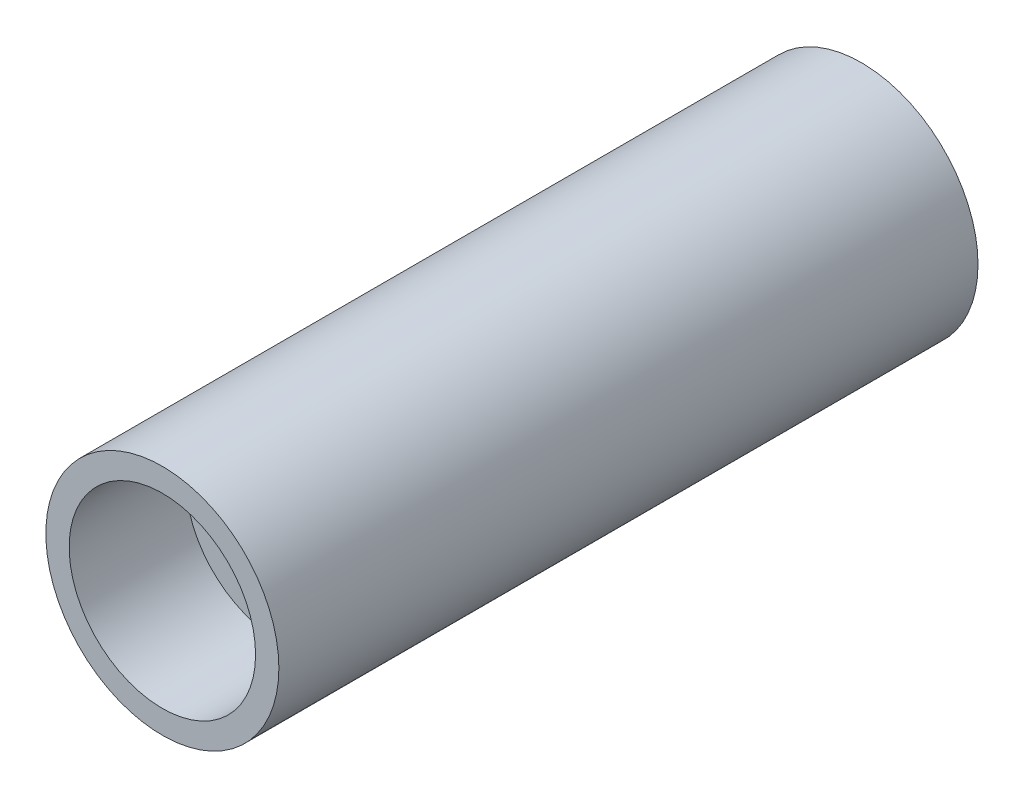
ISO-10303-21;
HEADER;
FILE_DESCRIPTION(('STEP AP214'),'2;1');
FILE_NAME('part.step','',(''),(''),'','','');
FILE_SCHEMA(('AUTOMOTIVE_DESIGN { 1 0 10303 214 1 1 1 1 }'));
ENDSEC;
DATA;
#1=APPLICATION_CONTEXT('core data for automotive mechanical design processes');
#2=APPLICATION_PROTOCOL_DEFINITION('international standard','automotive_design',2000,#1);
#3=PRODUCT_CONTEXT('',#1,'mechanical');
#4=PRODUCT('Part','Part','',(#3));
#5=PRODUCT_RELATED_PRODUCT_CATEGORY('part','',(#4));
#6=PRODUCT_DEFINITION_FORMATION('','',#4);
#7=PRODUCT_DEFINITION_CONTEXT('part definition',#1,'design');
#8=PRODUCT_DEFINITION('design','',#6,#7);
#9=PRODUCT_DEFINITION_SHAPE('','',#8);
#10=(LENGTH_UNIT() NAMED_UNIT(*) SI_UNIT(.MILLI.,.METRE.));
#11=(NAMED_UNIT(*) PLANE_ANGLE_UNIT() SI_UNIT($,.RADIAN.));
#12=(NAMED_UNIT(*) SI_UNIT($,.STERADIAN.) SOLID_ANGLE_UNIT());
#13=UNCERTAINTY_MEASURE_WITH_UNIT(LENGTH_MEASURE(1.E-05),#10,'distance_accuracy_value','');
#14=(GEOMETRIC_REPRESENTATION_CONTEXT(3) GLOBAL_UNCERTAINTY_ASSIGNED_CONTEXT((#13)) GLOBAL_UNIT_ASSIGNED_CONTEXT((#10,
#11,#12)) REPRESENTATION_CONTEXT('',''));
#15=CARTESIAN_POINT('',(0.,0.,0.));
#16=DIRECTION('',(0.,0.,1.));
#17=DIRECTION('',(1.,0.,0.));
#18=AXIS2_PLACEMENT_3D('',#15,#16,#17);
#19=CARTESIAN_POINT('',(0.,0.,30.));
#20=DIRECTION('',(0.,0.,-1.));
#21=DIRECTION('',(-1.,0.,0.));
#22=AXIS2_PLACEMENT_3D('',#19,#20,#21);
#23=CYLINDRICAL_SURFACE('',#22,5.);
#24=CARTESIAN_POINT('',(0.,0.,30.));
#25=DIRECTION('',(0.,0.,1.));
#26=DIRECTION('',(1.,0.,0.));
#27=AXIS2_PLACEMENT_3D('',#24,#25,#26);
#28=CIRCLE('',#27,5.);
#29=CARTESIAN_POINT('',(5.,0.,30.));
#30=VERTEX_POINT('',#29);
#31=EDGE_CURVE('E10',#30,#30,#28,.T.);
#32=ORIENTED_EDGE('',*,*,#31,.F.);
#33=EDGE_LOOP('',(#32));
#34=FACE_BOUND('',#33,.T.);
#35=CARTESIAN_POINT('',(0.,0.,0.));
#36=DIRECTION('',(0.,0.,1.));
#37=DIRECTION('',(1.,0.,0.));
#38=AXIS2_PLACEMENT_3D('',#35,#36,#37);
#39=CIRCLE('',#38,5.);
#40=CARTESIAN_POINT('',(5.,0.,0.));
#41=VERTEX_POINT('',#40);
#42=EDGE_CURVE('E34',#41,#41,#39,.T.);
#43=ORIENTED_EDGE('',*,*,#42,.T.);
#44=EDGE_LOOP('',(#43));
#45=FACE_BOUND('',#44,.T.);
#46=ADVANCED_FACE('F31',(#34,#45),#23,.T.);
#47=CARTESIAN_POINT('',(0.,0.,30.));
#48=DIRECTION('',(0.,0.,1.));
#49=DIRECTION('',(1.,0.,0.));
#50=AXIS2_PLACEMENT_3D('',#47,#48,#49);
#51=PLANE('',#50);
#52=CARTESIAN_POINT('',(0.,0.,30.));
#53=DIRECTION('',(0.,0.,1.));
#54=DIRECTION('',(1.,0.,0.));
#55=AXIS2_PLACEMENT_3D('',#52,#53,#54);
#56=CIRCLE('',#55,4.);
#57=CARTESIAN_POINT('',(4.,0.,30.));
#58=VERTEX_POINT('',#57);
#59=EDGE_CURVE('E43',#58,#58,#56,.T.);
#60=ORIENTED_EDGE('',*,*,#59,.F.);
#61=EDGE_LOOP('',(#60));
#62=FACE_BOUND('',#61,.T.);
#63=ORIENTED_EDGE('',*,*,#31,.T.);
#64=EDGE_LOOP('',(#63));
#65=FACE_BOUND('',#64,.T.);
#66=ADVANCED_FACE('F58',(#62,#65),#51,.T.);
#67=CARTESIAN_POINT('',(0.,0.,0.));
#68=DIRECTION('',(0.,0.,1.));
#69=DIRECTION('',(1.,0.,0.));
#70=AXIS2_PLACEMENT_3D('',#67,#68,#69);
#71=PLANE('',#70);
#72=ORIENTED_EDGE('',*,*,#42,.F.);
#73=EDGE_LOOP('',(#72));
#74=FACE_BOUND('',#73,.T.);
#75=ADVANCED_FACE('F54',(#74),#71,.F.);
#76=CARTESIAN_POINT('',(0.,0.,25.));
#77=DIRECTION('',(0.,0.,1.));
#78=DIRECTION('',(1.,0.,0.));
#79=AXIS2_PLACEMENT_3D('',#76,#77,#78);
#80=CYLINDRICAL_SURFACE('',#79,4.);
#81=CARTESIAN_POINT('',(0.,0.,25.));
#82=DIRECTION('',(0.,0.,1.));
#83=DIRECTION('',(1.,0.,0.));
#84=AXIS2_PLACEMENT_3D('',#81,#82,#83);
#85=CIRCLE('',#84,4.);
#86=CARTESIAN_POINT('',(4.,0.,25.));
#87=VERTEX_POINT('',#86);
#88=EDGE_CURVE('E41',#87,#87,#85,.T.);
#89=ORIENTED_EDGE('',*,*,#88,.F.);
#90=EDGE_LOOP('',(#89));
#91=FACE_BOUND('',#90,.T.);
#92=ORIENTED_EDGE('',*,*,#59,.T.);
#93=EDGE_LOOP('',(#92));
#94=FACE_BOUND('',#93,.T.);
#95=ADVANCED_FACE('F51',(#91,#94),#80,.F.);
#96=CARTESIAN_POINT('',(0.,0.,25.));
#97=DIRECTION('',(0.,0.,1.));
#98=DIRECTION('',(1.,0.,0.));
#99=AXIS2_PLACEMENT_3D('',#96,#97,#98);
#100=PLANE('',#99);
#101=ORIENTED_EDGE('',*,*,#88,.T.);
#102=EDGE_LOOP('',(#101));
#103=FACE_BOUND('',#102,.T.);
#104=ADVANCED_FACE('F49',(#103),#100,.T.);
#105=CLOSED_SHELL('',(#46,#66,#75,#95,#104));
#106=MANIFOLD_SOLID_BREP('B2',#105);
#107=ADVANCED_BREP_SHAPE_REPRESENTATION('',(#18,#106),#14);
#108=SHAPE_DEFINITION_REPRESENTATION(#9,#107);
ENDSEC;
END-ISO-10303-21;
